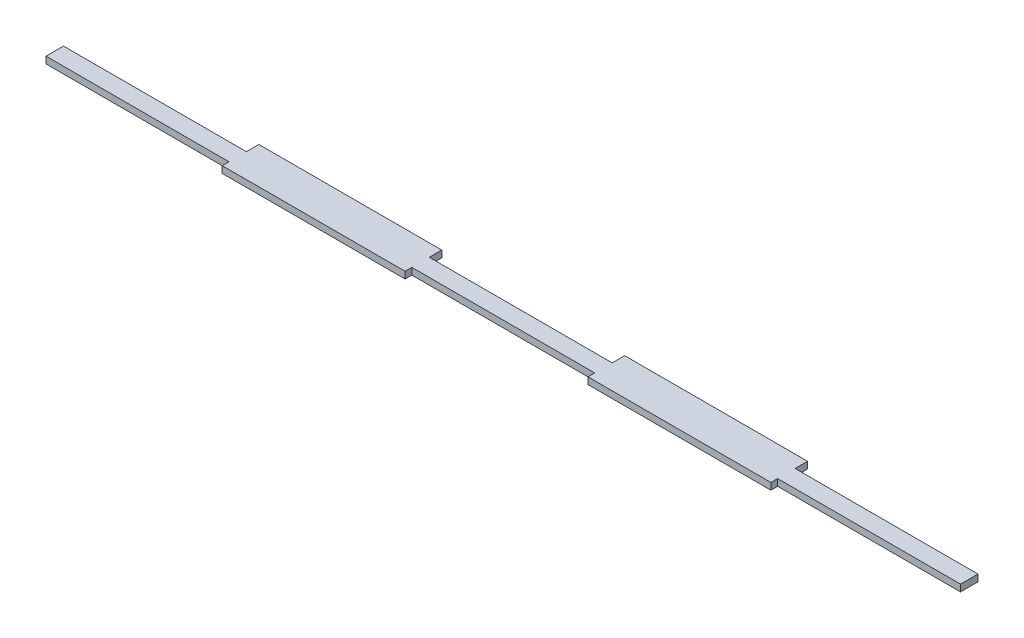
ISO-10303-21;
HEADER;
FILE_DESCRIPTION(('STEP AP214'),'2;1');
FILE_NAME('part.step','',(''),(''),'','','');
FILE_SCHEMA(('AUTOMOTIVE_DESIGN { 1 0 10303 214 1 1 1 1 }'));
ENDSEC;
DATA;
#1=APPLICATION_CONTEXT('core data for automotive mechanical design processes');
#2=APPLICATION_PROTOCOL_DEFINITION('international standard','automotive_design',2000,#1);
#3=PRODUCT_CONTEXT('',#1,'mechanical');
#4=PRODUCT('Part','Part','',(#3));
#5=PRODUCT_RELATED_PRODUCT_CATEGORY('part','',(#4));
#6=PRODUCT_DEFINITION_FORMATION('','',#4);
#7=PRODUCT_DEFINITION_CONTEXT('part definition',#1,'design');
#8=PRODUCT_DEFINITION('design','',#6,#7);
#9=PRODUCT_DEFINITION_SHAPE('','',#8);
#10=(LENGTH_UNIT() NAMED_UNIT(*) SI_UNIT(.MILLI.,.METRE.));
#11=(NAMED_UNIT(*) PLANE_ANGLE_UNIT() SI_UNIT($,.RADIAN.));
#12=(NAMED_UNIT(*) SI_UNIT($,.STERADIAN.) SOLID_ANGLE_UNIT());
#13=UNCERTAINTY_MEASURE_WITH_UNIT(LENGTH_MEASURE(1.E-05),#10,'distance_accuracy_value','');
#14=(GEOMETRIC_REPRESENTATION_CONTEXT(3) GLOBAL_UNCERTAINTY_ASSIGNED_CONTEXT((#13)) GLOBAL_UNIT_ASSIGNED_CONTEXT((#10,
#11,#12)) REPRESENTATION_CONTEXT('',''));
#15=CARTESIAN_POINT('',(0.,0.,0.));
#16=DIRECTION('',(0.,0.,1.));
#17=DIRECTION('',(1.,0.,0.));
#18=AXIS2_PLACEMENT_3D('',#15,#16,#17);
#19=CARTESIAN_POINT('',(-183.2,2.7,-4.32937020854507));
#20=DIRECTION('',(1.,0.,0.));
#21=DIRECTION('',(0.,0.,-1.));
#22=AXIS2_PLACEMENT_3D('',#19,#20,#21);
#23=PLANE('',#22);
#24=DIRECTION('',(0.,0.,1.));
#25=VECTOR('',#24,1.);
#26=CARTESIAN_POINT('',(-183.2,0.,-4.32937020854507));
#27=LINE('',#26,#25);
#28=CARTESIAN_POINT('',(-183.2,0.,-4.32937020854507));
#29=VERTEX_POINT('',#28);
#30=CARTESIAN_POINT('',(-183.2,0.,2.67062979145493));
#31=VERTEX_POINT('',#30);
#32=EDGE_CURVE('E201',#29,#31,#27,.T.);
#33=ORIENTED_EDGE('',*,*,#32,.T.);
#34=DIRECTION('',(0.,-1.,0.));
#35=VECTOR('',#34,1.);
#36=CARTESIAN_POINT('',(-183.2,2.7,2.67062979145493));
#37=LINE('',#36,#35);
#38=CARTESIAN_POINT('',(-183.2,2.7,2.67062979145493));
#39=VERTEX_POINT('',#38);
#40=EDGE_CURVE('E11',#39,#31,#37,.T.);
#41=ORIENTED_EDGE('',*,*,#40,.F.);
#42=DIRECTION('',(0.,0.,1.));
#43=VECTOR('',#42,1.);
#44=CARTESIAN_POINT('',(-183.2,2.7,-4.32937020854507));
#45=LINE('',#44,#43);
#46=CARTESIAN_POINT('',(-183.2,2.7,-4.32937020854507));
#47=VERTEX_POINT('',#46);
#48=EDGE_CURVE('E239',#47,#39,#45,.T.);
#49=ORIENTED_EDGE('',*,*,#48,.F.);
#50=DIRECTION('',(0.,-1.,0.));
#51=VECTOR('',#50,1.);
#52=CARTESIAN_POINT('',(-183.2,2.7,-4.32937020854507));
#53=LINE('',#52,#51);
#54=EDGE_CURVE('E197',#47,#29,#53,.T.);
#55=ORIENTED_EDGE('',*,*,#54,.T.);
#56=EDGE_LOOP('',(#33,#41,#49,#55));
#57=FACE_BOUND('',#56,.T.);
#58=ADVANCED_FACE('F33',(#57),#23,.F.);
#59=CARTESIAN_POINT('',(-183.2,2.7,2.67062979145493));
#60=DIRECTION('',(0.,0.,-1.));
#61=DIRECTION('',(-1.,0.,0.));
#62=AXIS2_PLACEMENT_3D('',#59,#60,#61);
#63=PLANE('',#62);
#64=DIRECTION('',(1.,0.,0.));
#65=VECTOR('',#64,1.);
#66=CARTESIAN_POINT('',(-183.2,0.,2.67062979145493));
#67=LINE('',#66,#65);
#68=CARTESIAN_POINT('',(-109.92,0.,2.67062979145493));
#69=VERTEX_POINT('',#68);
#70=EDGE_CURVE('E204',#31,#69,#67,.T.);
#71=ORIENTED_EDGE('',*,*,#70,.T.);
#72=DIRECTION('',(0.,-1.,0.));
#73=VECTOR('',#72,1.);
#74=CARTESIAN_POINT('',(-109.92,2.7,2.67062979145493));
#75=LINE('',#74,#73);
#76=CARTESIAN_POINT('',(-109.92,2.7,2.67062979145493));
#77=VERTEX_POINT('',#76);
#78=EDGE_CURVE('E41',#77,#69,#75,.T.);
#79=ORIENTED_EDGE('',*,*,#78,.F.);
#80=DIRECTION('',(1.,0.,0.));
#81=VECTOR('',#80,1.);
#82=CARTESIAN_POINT('',(-183.2,2.7,2.67062979145493));
#83=LINE('',#82,#81);
#84=EDGE_CURVE('E128',#39,#77,#83,.T.);
#85=ORIENTED_EDGE('',*,*,#84,.F.);
#86=ORIENTED_EDGE('',*,*,#40,.T.);
#87=EDGE_LOOP('',(#71,#79,#85,#86));
#88=FACE_BOUND('',#87,.T.);
#89=ADVANCED_FACE('F357',(#88),#63,.F.);
#90=CARTESIAN_POINT('',(-109.92,2.7,5.37062979145493));
#91=DIRECTION('',(1.,0.,0.));
#92=DIRECTION('',(0.,0.,-1.));
#93=AXIS2_PLACEMENT_3D('',#90,#91,#92);
#94=PLANE('',#93);
#95=DIRECTION('',(0.,0.,1.));
#96=VECTOR('',#95,1.);
#97=CARTESIAN_POINT('',(-109.92,0.,5.37062979145493));
#98=LINE('',#97,#96);
#99=CARTESIAN_POINT('',(-109.92,0.,5.37062979145493));
#100=VERTEX_POINT('',#99);
#101=EDGE_CURVE('E206',#69,#100,#98,.T.);
#102=ORIENTED_EDGE('',*,*,#101,.T.);
#103=DIRECTION('',(0.,-1.,0.));
#104=VECTOR('',#103,1.);
#105=CARTESIAN_POINT('',(-109.92,2.7,5.37062979145493));
#106=LINE('',#105,#104);
#107=CARTESIAN_POINT('',(-109.92,2.7,5.37062979145493));
#108=VERTEX_POINT('',#107);
#109=EDGE_CURVE('E282',#108,#100,#106,.T.);
#110=ORIENTED_EDGE('',*,*,#109,.F.);
#111=DIRECTION('',(0.,0.,1.));
#112=VECTOR('',#111,1.);
#113=CARTESIAN_POINT('',(-109.92,2.7,5.37062979145493));
#114=LINE('',#113,#112);
#115=EDGE_CURVE('E290',#77,#108,#114,.T.);
#116=ORIENTED_EDGE('',*,*,#115,.F.);
#117=ORIENTED_EDGE('',*,*,#78,.T.);
#118=EDGE_LOOP('',(#102,#110,#116,#117));
#119=FACE_BOUND('',#118,.T.);
#120=ADVANCED_FACE('F288',(#119),#94,.F.);
#121=CARTESIAN_POINT('',(-109.92,2.7,5.37062979145493));
#122=DIRECTION('',(0.,0.,-1.));
#123=DIRECTION('',(-1.,0.,0.));
#124=AXIS2_PLACEMENT_3D('',#121,#122,#123);
#125=PLANE('',#124);
#126=DIRECTION('',(1.,0.,0.));
#127=VECTOR('',#126,1.);
#128=CARTESIAN_POINT('',(-109.92,0.,5.37062979145493));
#129=LINE('',#128,#127);
#130=CARTESIAN_POINT('',(-36.64,0.,5.37062979145493));
#131=VERTEX_POINT('',#130);
#132=EDGE_CURVE('E208',#100,#131,#129,.T.);
#133=ORIENTED_EDGE('',*,*,#132,.T.);
#134=DIRECTION('',(0.,-1.,0.));
#135=VECTOR('',#134,1.);
#136=CARTESIAN_POINT('',(-36.64,2.7,5.37062979145493));
#137=LINE('',#136,#135);
#138=CARTESIAN_POINT('',(-36.64,2.7,5.37062979145493));
#139=VERTEX_POINT('',#138);
#140=EDGE_CURVE('E279',#139,#131,#137,.T.);
#141=ORIENTED_EDGE('',*,*,#140,.F.);
#142=DIRECTION('',(1.,0.,0.));
#143=VECTOR('',#142,1.);
#144=CARTESIAN_POINT('',(-109.92,2.7,5.37062979145493));
#145=LINE('',#144,#143);
#146=EDGE_CURVE('E308',#108,#139,#145,.T.);
#147=ORIENTED_EDGE('',*,*,#146,.F.);
#148=ORIENTED_EDGE('',*,*,#109,.T.);
#149=EDGE_LOOP('',(#133,#141,#147,#148));
#150=FACE_BOUND('',#149,.T.);
#151=ADVANCED_FACE('F299',(#150),#125,.F.);
#152=CARTESIAN_POINT('',(-36.64,2.7,5.37062979145493));
#153=DIRECTION('',(-1.,0.,0.));
#154=DIRECTION('',(0.,0.,1.));
#155=AXIS2_PLACEMENT_3D('',#152,#153,#154);
#156=PLANE('',#155);
#157=DIRECTION('',(0.,0.,-1.));
#158=VECTOR('',#157,1.);
#159=CARTESIAN_POINT('',(-36.64,0.,5.37062979145493));
#160=LINE('',#159,#158);
#161=CARTESIAN_POINT('',(-36.64,0.,2.67062979145493));
#162=VERTEX_POINT('',#161);
#163=EDGE_CURVE('E210',#131,#162,#160,.T.);
#164=ORIENTED_EDGE('',*,*,#163,.T.);
#165=DIRECTION('',(0.,-1.,0.));
#166=VECTOR('',#165,1.);
#167=CARTESIAN_POINT('',(-36.64,2.7,2.67062979145493));
#168=LINE('',#167,#166);
#169=CARTESIAN_POINT('',(-36.64,2.7,2.67062979145493));
#170=VERTEX_POINT('',#169);
#171=EDGE_CURVE('E276',#170,#162,#168,.T.);
#172=ORIENTED_EDGE('',*,*,#171,.F.);
#173=DIRECTION('',(0.,0.,-1.));
#174=VECTOR('',#173,1.);
#175=CARTESIAN_POINT('',(-36.64,2.7,5.37062979145493));
#176=LINE('',#175,#174);
#177=EDGE_CURVE('E305',#139,#170,#176,.T.);
#178=ORIENTED_EDGE('',*,*,#177,.F.);
#179=ORIENTED_EDGE('',*,*,#140,.T.);
#180=EDGE_LOOP('',(#164,#172,#178,#179));
#181=FACE_BOUND('',#180,.T.);
#182=ADVANCED_FACE('F303',(#181),#156,.F.);
#183=CARTESIAN_POINT('',(-36.64,2.7,2.67062979145493));
#184=DIRECTION('',(0.,0.,-1.));
#185=DIRECTION('',(-1.,0.,0.));
#186=AXIS2_PLACEMENT_3D('',#183,#184,#185);
#187=PLANE('',#186);
#188=DIRECTION('',(1.,0.,0.));
#189=VECTOR('',#188,1.);
#190=CARTESIAN_POINT('',(-36.64,0.,2.67062979145493));
#191=LINE('',#190,#189);
#192=CARTESIAN_POINT('',(36.64,0.,2.67062979145493));
#193=VERTEX_POINT('',#192);
#194=EDGE_CURVE('E212',#162,#193,#191,.T.);
#195=ORIENTED_EDGE('',*,*,#194,.T.);
#196=DIRECTION('',(0.,-1.,0.));
#197=VECTOR('',#196,1.);
#198=CARTESIAN_POINT('',(36.64,2.7,2.67062979145493));
#199=LINE('',#198,#197);
#200=CARTESIAN_POINT('',(36.64,2.7,2.67062979145493));
#201=VERTEX_POINT('',#200);
#202=EDGE_CURVE('E273',#201,#193,#199,.T.);
#203=ORIENTED_EDGE('',*,*,#202,.F.);
#204=DIRECTION('',(1.,0.,0.));
#205=VECTOR('',#204,1.);
#206=CARTESIAN_POINT('',(-36.64,2.7,2.67062979145493));
#207=LINE('',#206,#205);
#208=EDGE_CURVE('E307',#170,#201,#207,.T.);
#209=ORIENTED_EDGE('',*,*,#208,.F.);
#210=ORIENTED_EDGE('',*,*,#171,.T.);
#211=EDGE_LOOP('',(#195,#203,#209,#210));
#212=FACE_BOUND('',#211,.T.);
#213=ADVANCED_FACE('F370',(#212),#187,.F.);
#214=CARTESIAN_POINT('',(36.64,2.7,5.37062979145493));
#215=DIRECTION('',(1.,0.,0.));
#216=DIRECTION('',(0.,0.,-1.));
#217=AXIS2_PLACEMENT_3D('',#214,#215,#216);
#218=PLANE('',#217);
#219=DIRECTION('',(0.,0.,1.));
#220=VECTOR('',#219,1.);
#221=CARTESIAN_POINT('',(36.64,0.,5.37062979145493));
#222=LINE('',#221,#220);
#223=CARTESIAN_POINT('',(36.64,0.,5.37062979145493));
#224=VERTEX_POINT('',#223);
#225=EDGE_CURVE('E214',#193,#224,#222,.T.);
#226=ORIENTED_EDGE('',*,*,#225,.T.);
#227=DIRECTION('',(0.,-1.,0.));
#228=VECTOR('',#227,1.);
#229=CARTESIAN_POINT('',(36.64,2.7,5.37062979145493));
#230=LINE('',#229,#228);
#231=CARTESIAN_POINT('',(36.64,2.7,5.37062979145493));
#232=VERTEX_POINT('',#231);
#233=EDGE_CURVE('E270',#232,#224,#230,.T.);
#234=ORIENTED_EDGE('',*,*,#233,.F.);
#235=DIRECTION('',(0.,0.,1.));
#236=VECTOR('',#235,1.);
#237=CARTESIAN_POINT('',(36.64,2.7,5.37062979145493));
#238=LINE('',#237,#236);
#239=EDGE_CURVE('E310',#201,#232,#238,.T.);
#240=ORIENTED_EDGE('',*,*,#239,.F.);
#241=ORIENTED_EDGE('',*,*,#202,.T.);
#242=EDGE_LOOP('',(#226,#234,#240,#241));
#243=FACE_BOUND('',#242,.T.);
#244=ADVANCED_FACE('F373',(#243),#218,.F.);
#245=CARTESIAN_POINT('',(36.64,2.7,5.37062979145493));
#246=DIRECTION('',(0.,0.,-1.));
#247=DIRECTION('',(-1.,0.,0.));
#248=AXIS2_PLACEMENT_3D('',#245,#246,#247);
#249=PLANE('',#248);
#250=DIRECTION('',(1.,0.,0.));
#251=VECTOR('',#250,1.);
#252=CARTESIAN_POINT('',(36.64,0.,5.37062979145493));
#253=LINE('',#252,#251);
#254=CARTESIAN_POINT('',(109.92,0.,5.37062979145493));
#255=VERTEX_POINT('',#254);
#256=EDGE_CURVE('E216',#224,#255,#253,.T.);
#257=ORIENTED_EDGE('',*,*,#256,.T.);
#258=DIRECTION('',(0.,-1.,0.));
#259=VECTOR('',#258,1.);
#260=CARTESIAN_POINT('',(109.92,2.7,5.37062979145493));
#261=LINE('',#260,#259);
#262=CARTESIAN_POINT('',(109.92,2.7,5.37062979145493));
#263=VERTEX_POINT('',#262);
#264=EDGE_CURVE('E267',#263,#255,#261,.T.);
#265=ORIENTED_EDGE('',*,*,#264,.F.);
#266=DIRECTION('',(1.,0.,0.));
#267=VECTOR('',#266,1.);
#268=CARTESIAN_POINT('',(36.64,2.7,5.37062979145493));
#269=LINE('',#268,#267);
#270=EDGE_CURVE('E316',#232,#263,#269,.T.);
#271=ORIENTED_EDGE('',*,*,#270,.F.);
#272=ORIENTED_EDGE('',*,*,#233,.T.);
#273=EDGE_LOOP('',(#257,#265,#271,#272));
#274=FACE_BOUND('',#273,.T.);
#275=ADVANCED_FACE('F377',(#274),#249,.F.);
#276=CARTESIAN_POINT('',(109.92,2.7,5.37062979145493));
#277=DIRECTION('',(-1.,0.,0.));
#278=DIRECTION('',(0.,0.,1.));
#279=AXIS2_PLACEMENT_3D('',#276,#277,#278);
#280=PLANE('',#279);
#281=DIRECTION('',(0.,0.,-1.));
#282=VECTOR('',#281,1.);
#283=CARTESIAN_POINT('',(109.92,0.,5.37062979145493));
#284=LINE('',#283,#282);
#285=CARTESIAN_POINT('',(109.92,0.,2.67062979145493));
#286=VERTEX_POINT('',#285);
#287=EDGE_CURVE('E218',#255,#286,#284,.T.);
#288=ORIENTED_EDGE('',*,*,#287,.T.);
#289=DIRECTION('',(0.,-1.,0.));
#290=VECTOR('',#289,1.);
#291=CARTESIAN_POINT('',(109.92,2.7,2.67062979145493));
#292=LINE('',#291,#290);
#293=CARTESIAN_POINT('',(109.92,2.7,2.67062979145493));
#294=VERTEX_POINT('',#293);
#295=EDGE_CURVE('E264',#294,#286,#292,.T.);
#296=ORIENTED_EDGE('',*,*,#295,.F.);
#297=DIRECTION('',(0.,0.,-1.));
#298=VECTOR('',#297,1.);
#299=CARTESIAN_POINT('',(109.92,2.7,5.37062979145493));
#300=LINE('',#299,#298);
#301=EDGE_CURVE('E318',#263,#294,#300,.T.);
#302=ORIENTED_EDGE('',*,*,#301,.F.);
#303=ORIENTED_EDGE('',*,*,#264,.T.);
#304=EDGE_LOOP('',(#288,#296,#302,#303));
#305=FACE_BOUND('',#304,.T.);
#306=ADVANCED_FACE('F381',(#305),#280,.F.);
#307=CARTESIAN_POINT('',(109.92,2.7,2.67062979145493));
#308=DIRECTION('',(0.,0.,-1.));
#309=DIRECTION('',(-1.,0.,0.));
#310=AXIS2_PLACEMENT_3D('',#307,#308,#309);
#311=PLANE('',#310);
#312=DIRECTION('',(1.,0.,0.));
#313=VECTOR('',#312,1.);
#314=CARTESIAN_POINT('',(109.92,0.,2.67062979145493));
#315=LINE('',#314,#313);
#316=CARTESIAN_POINT('',(183.2,0.,2.67062979145493));
#317=VERTEX_POINT('',#316);
#318=EDGE_CURVE('E220',#286,#317,#315,.T.);
#319=ORIENTED_EDGE('',*,*,#318,.T.);
#320=DIRECTION('',(0.,-1.,0.));
#321=VECTOR('',#320,1.);
#322=CARTESIAN_POINT('',(183.2,2.7,2.67062979145493));
#323=LINE('',#322,#321);
#324=CARTESIAN_POINT('',(183.2,2.7,2.67062979145493));
#325=VERTEX_POINT('',#324);
#326=EDGE_CURVE('E261',#325,#317,#323,.T.);
#327=ORIENTED_EDGE('',*,*,#326,.F.);
#328=DIRECTION('',(1.,0.,0.));
#329=VECTOR('',#328,1.);
#330=CARTESIAN_POINT('',(109.92,2.7,2.67062979145493));
#331=LINE('',#330,#329);
#332=EDGE_CURVE('E320',#294,#325,#331,.T.);
#333=ORIENTED_EDGE('',*,*,#332,.F.);
#334=ORIENTED_EDGE('',*,*,#295,.T.);
#335=EDGE_LOOP('',(#319,#327,#333,#334));
#336=FACE_BOUND('',#335,.T.);
#337=ADVANCED_FACE('F385',(#336),#311,.F.);
#338=CARTESIAN_POINT('',(183.2,2.7,-4.32937020854507));
#339=DIRECTION('',(-1.,0.,0.));
#340=DIRECTION('',(0.,0.,1.));
#341=AXIS2_PLACEMENT_3D('',#338,#339,#340);
#342=PLANE('',#341);
#343=DIRECTION('',(0.,0.,-1.));
#344=VECTOR('',#343,1.);
#345=CARTESIAN_POINT('',(183.2,0.,-4.32937020854507));
#346=LINE('',#345,#344);
#347=CARTESIAN_POINT('',(183.2,0.,-4.32937020854507));
#348=VERTEX_POINT('',#347);
#349=EDGE_CURVE('E222',#317,#348,#346,.T.);
#350=ORIENTED_EDGE('',*,*,#349,.T.);
#351=DIRECTION('',(0.,-1.,0.));
#352=VECTOR('',#351,1.);
#353=CARTESIAN_POINT('',(183.2,2.7,-4.32937020854507));
#354=LINE('',#353,#352);
#355=CARTESIAN_POINT('',(183.2,2.7,-4.32937020854507));
#356=VERTEX_POINT('',#355);
#357=EDGE_CURVE('E258',#356,#348,#354,.T.);
#358=ORIENTED_EDGE('',*,*,#357,.F.);
#359=DIRECTION('',(0.,0.,-1.));
#360=VECTOR('',#359,1.);
#361=CARTESIAN_POINT('',(183.2,2.7,-4.32937020854507));
#362=LINE('',#361,#360);
#363=EDGE_CURVE('E322',#325,#356,#362,.T.);
#364=ORIENTED_EDGE('',*,*,#363,.F.);
#365=ORIENTED_EDGE('',*,*,#326,.T.);
#366=EDGE_LOOP('',(#350,#358,#364,#365));
#367=FACE_BOUND('',#366,.T.);
#368=ADVANCED_FACE('F389',(#367),#342,.F.);
#369=CARTESIAN_POINT('',(109.92,2.7,-4.32937020854507));
#370=DIRECTION('',(0.,0.,1.));
#371=DIRECTION('',(1.,0.,0.));
#372=AXIS2_PLACEMENT_3D('',#369,#370,#371);
#373=PLANE('',#372);
#374=DIRECTION('',(-1.,0.,0.));
#375=VECTOR('',#374,1.);
#376=CARTESIAN_POINT('',(109.92,0.,-4.32937020854507));
#377=LINE('',#376,#375);
#378=CARTESIAN_POINT('',(109.92,0.,-4.32937020854507));
#379=VERTEX_POINT('',#378);
#380=EDGE_CURVE('E224',#348,#379,#377,.T.);
#381=ORIENTED_EDGE('',*,*,#380,.T.);
#382=DIRECTION('',(0.,-1.,0.));
#383=VECTOR('',#382,1.);
#384=CARTESIAN_POINT('',(109.92,2.7,-4.32937020854507));
#385=LINE('',#384,#383);
#386=CARTESIAN_POINT('',(109.92,2.7,-4.32937020854507));
#387=VERTEX_POINT('',#386);
#388=EDGE_CURVE('E255',#387,#379,#385,.T.);
#389=ORIENTED_EDGE('',*,*,#388,.F.);
#390=DIRECTION('',(-1.,0.,0.));
#391=VECTOR('',#390,1.);
#392=CARTESIAN_POINT('',(109.92,2.7,-4.32937020854507));
#393=LINE('',#392,#391);
#394=EDGE_CURVE('E324',#356,#387,#393,.T.);
#395=ORIENTED_EDGE('',*,*,#394,.F.);
#396=ORIENTED_EDGE('',*,*,#357,.T.);
#397=EDGE_LOOP('',(#381,#389,#395,#396));
#398=FACE_BOUND('',#397,.T.);
#399=ADVANCED_FACE('F393',(#398),#373,.F.);
#400=CARTESIAN_POINT('',(109.92,2.7,-9.32937020854507));
#401=DIRECTION('',(-1.,0.,0.));
#402=DIRECTION('',(0.,0.,1.));
#403=AXIS2_PLACEMENT_3D('',#400,#401,#402);
#404=PLANE('',#403);
#405=DIRECTION('',(0.,0.,-1.));
#406=VECTOR('',#405,1.);
#407=CARTESIAN_POINT('',(109.92,0.,-9.32937020854507));
#408=LINE('',#407,#406);
#409=CARTESIAN_POINT('',(109.92,0.,-9.32937020854507));
#410=VERTEX_POINT('',#409);
#411=EDGE_CURVE('E226',#379,#410,#408,.T.);
#412=ORIENTED_EDGE('',*,*,#411,.T.);
#413=DIRECTION('',(0.,-1.,0.));
#414=VECTOR('',#413,1.);
#415=CARTESIAN_POINT('',(109.92,2.7,-9.32937020854507));
#416=LINE('',#415,#414);
#417=CARTESIAN_POINT('',(109.92,2.7,-9.32937020854507));
#418=VERTEX_POINT('',#417);
#419=EDGE_CURVE('E252',#418,#410,#416,.T.);
#420=ORIENTED_EDGE('',*,*,#419,.F.);
#421=DIRECTION('',(0.,0.,-1.));
#422=VECTOR('',#421,1.);
#423=CARTESIAN_POINT('',(109.92,2.7,-9.32937020854507));
#424=LINE('',#423,#422);
#425=EDGE_CURVE('E326',#387,#418,#424,.T.);
#426=ORIENTED_EDGE('',*,*,#425,.F.);
#427=ORIENTED_EDGE('',*,*,#388,.T.);
#428=EDGE_LOOP('',(#412,#420,#426,#427));
#429=FACE_BOUND('',#428,.T.);
#430=ADVANCED_FACE('F397',(#429),#404,.F.);
#431=CARTESIAN_POINT('',(36.64,2.7,-9.32937020854507));
#432=DIRECTION('',(0.,0.,1.));
#433=DIRECTION('',(1.,0.,0.));
#434=AXIS2_PLACEMENT_3D('',#431,#432,#433);
#435=PLANE('',#434);
#436=DIRECTION('',(-1.,0.,0.));
#437=VECTOR('',#436,1.);
#438=CARTESIAN_POINT('',(36.64,0.,-9.32937020854507));
#439=LINE('',#438,#437);
#440=CARTESIAN_POINT('',(36.64,0.,-9.32937020854507));
#441=VERTEX_POINT('',#440);
#442=EDGE_CURVE('E228',#410,#441,#439,.T.);
#443=ORIENTED_EDGE('',*,*,#442,.T.);
#444=DIRECTION('',(0.,-1.,0.));
#445=VECTOR('',#444,1.);
#446=CARTESIAN_POINT('',(36.64,2.7,-9.32937020854507));
#447=LINE('',#446,#445);
#448=CARTESIAN_POINT('',(36.64,2.7,-9.32937020854507));
#449=VERTEX_POINT('',#448);
#450=EDGE_CURVE('E249',#449,#441,#447,.T.);
#451=ORIENTED_EDGE('',*,*,#450,.F.);
#452=DIRECTION('',(-1.,0.,0.));
#453=VECTOR('',#452,1.);
#454=CARTESIAN_POINT('',(36.64,2.7,-9.32937020854507));
#455=LINE('',#454,#453);
#456=EDGE_CURVE('E328',#418,#449,#455,.T.);
#457=ORIENTED_EDGE('',*,*,#456,.F.);
#458=ORIENTED_EDGE('',*,*,#419,.T.);
#459=EDGE_LOOP('',(#443,#451,#457,#458));
#460=FACE_BOUND('',#459,.T.);
#461=ADVANCED_FACE('F401',(#460),#435,.F.);
#462=CARTESIAN_POINT('',(36.64,2.7,-9.32937020854507));
#463=DIRECTION('',(1.,0.,0.));
#464=DIRECTION('',(0.,0.,-1.));
#465=AXIS2_PLACEMENT_3D('',#462,#463,#464);
#466=PLANE('',#465);
#467=DIRECTION('',(0.,0.,1.));
#468=VECTOR('',#467,1.);
#469=CARTESIAN_POINT('',(36.64,0.,-9.32937020854507));
#470=LINE('',#469,#468);
#471=CARTESIAN_POINT('',(36.64,0.,-4.32937020854507));
#472=VERTEX_POINT('',#471);
#473=EDGE_CURVE('E230',#441,#472,#470,.T.);
#474=ORIENTED_EDGE('',*,*,#473,.T.);
#475=DIRECTION('',(0.,-1.,0.));
#476=VECTOR('',#475,1.);
#477=CARTESIAN_POINT('',(36.64,2.7,-4.32937020854507));
#478=LINE('',#477,#476);
#479=CARTESIAN_POINT('',(36.64,2.7,-4.32937020854507));
#480=VERTEX_POINT('',#479);
#481=EDGE_CURVE('E246',#480,#472,#478,.T.);
#482=ORIENTED_EDGE('',*,*,#481,.F.);
#483=DIRECTION('',(0.,0.,1.));
#484=VECTOR('',#483,1.);
#485=CARTESIAN_POINT('',(36.64,2.7,-9.32937020854507));
#486=LINE('',#485,#484);
#487=EDGE_CURVE('E330',#449,#480,#486,.T.);
#488=ORIENTED_EDGE('',*,*,#487,.F.);
#489=ORIENTED_EDGE('',*,*,#450,.T.);
#490=EDGE_LOOP('',(#474,#482,#488,#489));
#491=FACE_BOUND('',#490,.T.);
#492=ADVANCED_FACE('F405',(#491),#466,.F.);
#493=CARTESIAN_POINT('',(-36.64,2.7,-4.32937020854507));
#494=DIRECTION('',(0.,0.,1.));
#495=DIRECTION('',(1.,0.,0.));
#496=AXIS2_PLACEMENT_3D('',#493,#494,#495);
#497=PLANE('',#496);
#498=DIRECTION('',(-1.,0.,0.));
#499=VECTOR('',#498,1.);
#500=CARTESIAN_POINT('',(-36.64,0.,-4.32937020854507));
#501=LINE('',#500,#499);
#502=CARTESIAN_POINT('',(-36.64,0.,-4.32937020854507));
#503=VERTEX_POINT('',#502);
#504=EDGE_CURVE('E232',#472,#503,#501,.T.);
#505=ORIENTED_EDGE('',*,*,#504,.T.);
#506=DIRECTION('',(0.,-1.,0.));
#507=VECTOR('',#506,1.);
#508=CARTESIAN_POINT('',(-36.64,2.7,-4.32937020854507));
#509=LINE('',#508,#507);
#510=CARTESIAN_POINT('',(-36.64,2.7,-4.32937020854507));
#511=VERTEX_POINT('',#510);
#512=EDGE_CURVE('E243',#511,#503,#509,.T.);
#513=ORIENTED_EDGE('',*,*,#512,.F.);
#514=DIRECTION('',(-1.,0.,0.));
#515=VECTOR('',#514,1.);
#516=CARTESIAN_POINT('',(-36.64,2.7,-4.32937020854507));
#517=LINE('',#516,#515);
#518=EDGE_CURVE('E332',#480,#511,#517,.T.);
#519=ORIENTED_EDGE('',*,*,#518,.F.);
#520=ORIENTED_EDGE('',*,*,#481,.T.);
#521=EDGE_LOOP('',(#505,#513,#519,#520));
#522=FACE_BOUND('',#521,.T.);
#523=ADVANCED_FACE('F338',(#522),#497,.F.);
#524=CARTESIAN_POINT('',(-36.64,2.7,-9.32937020854507));
#525=DIRECTION('',(-1.,0.,0.));
#526=DIRECTION('',(0.,0.,1.));
#527=AXIS2_PLACEMENT_3D('',#524,#525,#526);
#528=PLANE('',#527);
#529=DIRECTION('',(0.,0.,-1.));
#530=VECTOR('',#529,1.);
#531=CARTESIAN_POINT('',(-36.64,0.,-9.32937020854507));
#532=LINE('',#531,#530);
#533=CARTESIAN_POINT('',(-36.64,0.,-9.32937020854507));
#534=VERTEX_POINT('',#533);
#535=EDGE_CURVE('E234',#503,#534,#532,.T.);
#536=ORIENTED_EDGE('',*,*,#535,.T.);
#537=DIRECTION('',(0.,-1.,0.));
#538=VECTOR('',#537,1.);
#539=CARTESIAN_POINT('',(-36.64,2.7,-9.32937020854507));
#540=LINE('',#539,#538);
#541=CARTESIAN_POINT('',(-36.64,2.7,-9.32937020854507));
#542=VERTEX_POINT('',#541);
#543=EDGE_CURVE('E192',#542,#534,#540,.T.);
#544=ORIENTED_EDGE('',*,*,#543,.F.);
#545=DIRECTION('',(0.,0.,-1.));
#546=VECTOR('',#545,1.);
#547=CARTESIAN_POINT('',(-36.64,2.7,-9.32937020854507));
#548=LINE('',#547,#546);
#549=EDGE_CURVE('E183',#511,#542,#548,.T.);
#550=ORIENTED_EDGE('',*,*,#549,.F.);
#551=ORIENTED_EDGE('',*,*,#512,.T.);
#552=EDGE_LOOP('',(#536,#544,#550,#551));
#553=FACE_BOUND('',#552,.T.);
#554=ADVANCED_FACE('F342',(#553),#528,.F.);
#555=CARTESIAN_POINT('',(-109.92,2.7,-9.32937020854507));
#556=DIRECTION('',(0.,0.,1.));
#557=DIRECTION('',(1.,0.,0.));
#558=AXIS2_PLACEMENT_3D('',#555,#556,#557);
#559=PLANE('',#558);
#560=DIRECTION('',(-1.,0.,0.));
#561=VECTOR('',#560,1.);
#562=CARTESIAN_POINT('',(-109.92,0.,-9.32937020854507));
#563=LINE('',#562,#561);
#564=CARTESIAN_POINT('',(-109.92,0.,-9.32937020854507));
#565=VERTEX_POINT('',#564);
#566=EDGE_CURVE('E191',#534,#565,#563,.T.);
#567=ORIENTED_EDGE('',*,*,#566,.T.);
#568=DIRECTION('',(0.,-1.,0.));
#569=VECTOR('',#568,1.);
#570=CARTESIAN_POINT('',(-109.92,2.7,-9.32937020854507));
#571=LINE('',#570,#569);
#572=CARTESIAN_POINT('',(-109.92,2.7,-9.32937020854507));
#573=VERTEX_POINT('',#572);
#574=EDGE_CURVE('E188',#573,#565,#571,.T.);
#575=ORIENTED_EDGE('',*,*,#574,.F.);
#576=DIRECTION('',(-1.,0.,0.));
#577=VECTOR('',#576,1.);
#578=CARTESIAN_POINT('',(-109.92,2.7,-9.32937020854507));
#579=LINE('',#578,#577);
#580=EDGE_CURVE('E177',#542,#573,#579,.T.);
#581=ORIENTED_EDGE('',*,*,#580,.F.);
#582=ORIENTED_EDGE('',*,*,#543,.T.);
#583=EDGE_LOOP('',(#567,#575,#581,#582));
#584=FACE_BOUND('',#583,.T.);
#585=ADVANCED_FACE('F189',(#584),#559,.F.);
#586=CARTESIAN_POINT('',(-109.92,2.7,-9.32937020854507));
#587=DIRECTION('',(1.,0.,0.));
#588=DIRECTION('',(0.,0.,-1.));
#589=AXIS2_PLACEMENT_3D('',#586,#587,#588);
#590=PLANE('',#589);
#591=DIRECTION('',(0.,0.,1.));
#592=VECTOR('',#591,1.);
#593=CARTESIAN_POINT('',(-109.92,0.,-9.32937020854507));
#594=LINE('',#593,#592);
#595=CARTESIAN_POINT('',(-109.92,0.,-4.32937020854507));
#596=VERTEX_POINT('',#595);
#597=EDGE_CURVE('E114',#565,#596,#594,.T.);
#598=ORIENTED_EDGE('',*,*,#597,.T.);
#599=DIRECTION('',(0.,-1.,0.));
#600=VECTOR('',#599,1.);
#601=CARTESIAN_POINT('',(-109.92,2.7,-4.32937020854507));
#602=LINE('',#601,#600);
#603=CARTESIAN_POINT('',(-109.92,2.7,-4.32937020854507));
#604=VERTEX_POINT('',#603);
#605=EDGE_CURVE('E193',#604,#596,#602,.T.);
#606=ORIENTED_EDGE('',*,*,#605,.F.);
#607=DIRECTION('',(0.,0.,1.));
#608=VECTOR('',#607,1.);
#609=CARTESIAN_POINT('',(-109.92,2.7,-9.32937020854507));
#610=LINE('',#609,#608);
#611=EDGE_CURVE('E181',#573,#604,#610,.T.);
#612=ORIENTED_EDGE('',*,*,#611,.F.);
#613=ORIENTED_EDGE('',*,*,#574,.T.);
#614=EDGE_LOOP('',(#598,#606,#612,#613));
#615=FACE_BOUND('',#614,.T.);
#616=ADVANCED_FACE('F195',(#615),#590,.F.);
#617=CARTESIAN_POINT('',(-183.2,2.7,-4.32937020854507));
#618=DIRECTION('',(0.,0.,1.));
#619=DIRECTION('',(1.,0.,0.));
#620=AXIS2_PLACEMENT_3D('',#617,#618,#619);
#621=PLANE('',#620);
#622=DIRECTION('',(-1.,0.,0.));
#623=VECTOR('',#622,1.);
#624=CARTESIAN_POINT('',(-183.2,0.,-4.32937020854507));
#625=LINE('',#624,#623);
#626=EDGE_CURVE('E120',#596,#29,#625,.T.);
#627=ORIENTED_EDGE('',*,*,#626,.T.);
#628=ORIENTED_EDGE('',*,*,#54,.F.);
#629=DIRECTION('',(-1.,0.,0.));
#630=VECTOR('',#629,1.);
#631=CARTESIAN_POINT('',(-183.2,2.7,-4.32937020854507));
#632=LINE('',#631,#630);
#633=EDGE_CURVE('E49',#604,#47,#632,.T.);
#634=ORIENTED_EDGE('',*,*,#633,.F.);
#635=ORIENTED_EDGE('',*,*,#605,.T.);
#636=EDGE_LOOP('',(#627,#628,#634,#635));
#637=FACE_BOUND('',#636,.T.);
#638=ADVANCED_FACE('F346',(#637),#621,.F.);
#639=CARTESIAN_POINT('',(0.,2.7,0.));
#640=DIRECTION('',(0.,1.,0.));
#641=DIRECTION('',(0.,0.,1.));
#642=AXIS2_PLACEMENT_3D('',#639,#640,#641);
#643=PLANE('',#642);
#644=ORIENTED_EDGE('',*,*,#48,.T.);
#645=ORIENTED_EDGE('',*,*,#84,.T.);
#646=ORIENTED_EDGE('',*,*,#115,.T.);
#647=ORIENTED_EDGE('',*,*,#146,.T.);
#648=ORIENTED_EDGE('',*,*,#177,.T.);
#649=ORIENTED_EDGE('',*,*,#208,.T.);
#650=ORIENTED_EDGE('',*,*,#239,.T.);
#651=ORIENTED_EDGE('',*,*,#270,.T.);
#652=ORIENTED_EDGE('',*,*,#301,.T.);
#653=ORIENTED_EDGE('',*,*,#332,.T.);
#654=ORIENTED_EDGE('',*,*,#363,.T.);
#655=ORIENTED_EDGE('',*,*,#394,.T.);
#656=ORIENTED_EDGE('',*,*,#425,.T.);
#657=ORIENTED_EDGE('',*,*,#456,.T.);
#658=ORIENTED_EDGE('',*,*,#487,.T.);
#659=ORIENTED_EDGE('',*,*,#518,.T.);
#660=ORIENTED_EDGE('',*,*,#549,.T.);
#661=ORIENTED_EDGE('',*,*,#580,.T.);
#662=ORIENTED_EDGE('',*,*,#611,.T.);
#663=ORIENTED_EDGE('',*,*,#633,.T.);
#664=EDGE_LOOP('',(#644,#645,#646,#647,#648,#649,#650,#651,#652,#653,#654,#655,#656,#657,#658,
#659,#660,#661,#662,#663));
#665=FACE_BOUND('',#664,.T.);
#666=ADVANCED_FACE('F179',(#665),#643,.T.);
#667=CARTESIAN_POINT('',(0.,0.,0.));
#668=DIRECTION('',(0.,1.,0.));
#669=DIRECTION('',(0.,0.,1.));
#670=AXIS2_PLACEMENT_3D('',#667,#668,#669);
#671=PLANE('',#670);
#672=ORIENTED_EDGE('',*,*,#32,.F.);
#673=ORIENTED_EDGE('',*,*,#626,.F.);
#674=ORIENTED_EDGE('',*,*,#597,.F.);
#675=ORIENTED_EDGE('',*,*,#566,.F.);
#676=ORIENTED_EDGE('',*,*,#535,.F.);
#677=ORIENTED_EDGE('',*,*,#504,.F.);
#678=ORIENTED_EDGE('',*,*,#473,.F.);
#679=ORIENTED_EDGE('',*,*,#442,.F.);
#680=ORIENTED_EDGE('',*,*,#411,.F.);
#681=ORIENTED_EDGE('',*,*,#380,.F.);
#682=ORIENTED_EDGE('',*,*,#349,.F.);
#683=ORIENTED_EDGE('',*,*,#318,.F.);
#684=ORIENTED_EDGE('',*,*,#287,.F.);
#685=ORIENTED_EDGE('',*,*,#256,.F.);
#686=ORIENTED_EDGE('',*,*,#225,.F.);
#687=ORIENTED_EDGE('',*,*,#194,.F.);
#688=ORIENTED_EDGE('',*,*,#163,.F.);
#689=ORIENTED_EDGE('',*,*,#132,.F.);
#690=ORIENTED_EDGE('',*,*,#101,.F.);
#691=ORIENTED_EDGE('',*,*,#70,.F.);
#692=EDGE_LOOP('',(#672,#673,#674,#675,#676,#677,#678,#679,#680,#681,#682,#683,#684,#685,#686,
#687,#688,#689,#690,#691));
#693=FACE_BOUND('',#692,.T.);
#694=ADVANCED_FACE('F294',(#693),#671,.F.);
#695=CLOSED_SHELL('',(#58,#89,#120,#151,#182,#213,#244,#275,#306,#337,#368,#399,#430,#461,#492,
#523,#554,#585,#616,#638,#666,#694));
#696=MANIFOLD_SOLID_BREP('B2',#695);
#697=ADVANCED_BREP_SHAPE_REPRESENTATION('',(#18,#696),#14);
#698=SHAPE_DEFINITION_REPRESENTATION(#9,#697);
ENDSEC;
END-ISO-10303-21;
